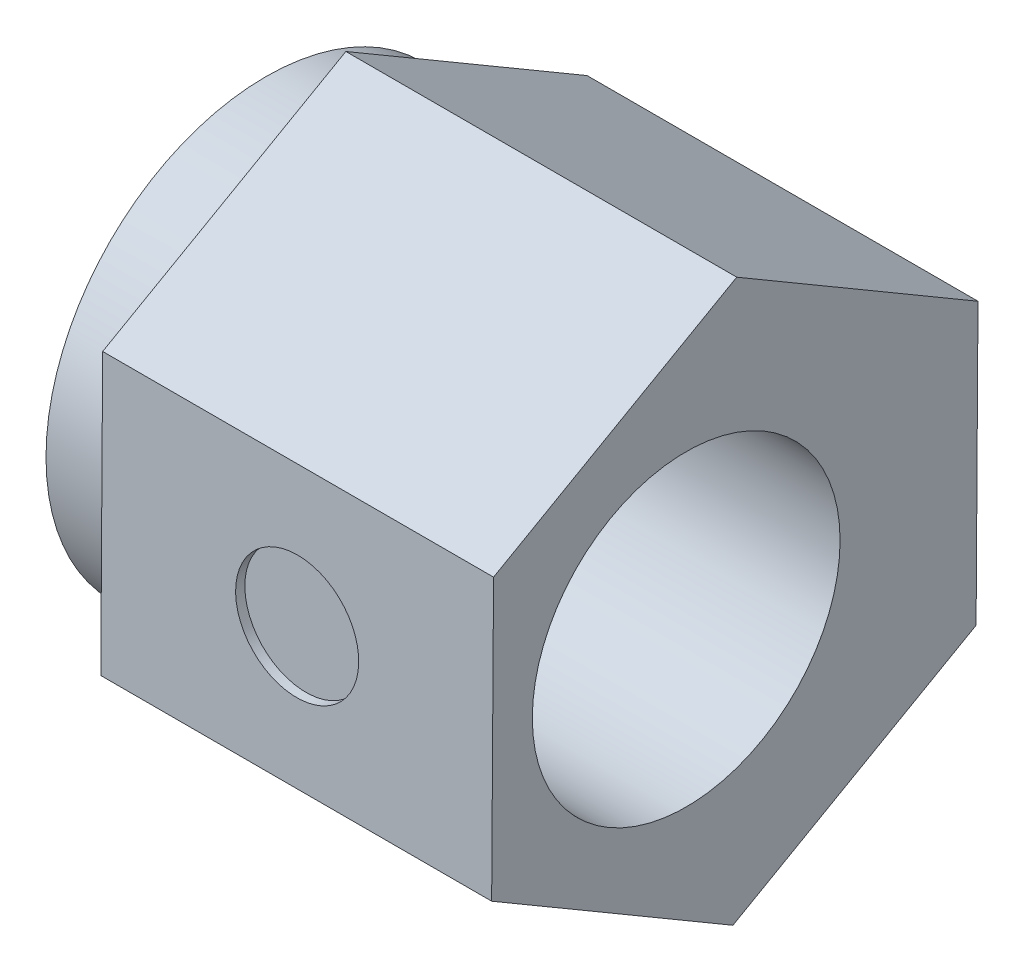
ISO-10303-21;
HEADER;
FILE_DESCRIPTION(('STEP AP214'),'2;1');
FILE_NAME('part.step','',(''),(''),'','','');
FILE_SCHEMA(('AUTOMOTIVE_DESIGN { 1 0 10303 214 1 1 1 1 }'));
ENDSEC;
DATA;
#1=APPLICATION_CONTEXT('core data for automotive mechanical design processes');
#2=APPLICATION_PROTOCOL_DEFINITION('international standard','automotive_design',2000,#1);
#3=PRODUCT_CONTEXT('',#1,'mechanical');
#4=PRODUCT('Part','Part','',(#3));
#5=PRODUCT_RELATED_PRODUCT_CATEGORY('part','',(#4));
#6=PRODUCT_DEFINITION_FORMATION('','',#4);
#7=PRODUCT_DEFINITION_CONTEXT('part definition',#1,'design');
#8=PRODUCT_DEFINITION('design','',#6,#7);
#9=PRODUCT_DEFINITION_SHAPE('','',#8);
#10=(LENGTH_UNIT() NAMED_UNIT(*) SI_UNIT(.MILLI.,.METRE.));
#11=(NAMED_UNIT(*) PLANE_ANGLE_UNIT() SI_UNIT($,.RADIAN.));
#12=(NAMED_UNIT(*) SI_UNIT($,.STERADIAN.) SOLID_ANGLE_UNIT());
#13=UNCERTAINTY_MEASURE_WITH_UNIT(LENGTH_MEASURE(1.E-05),#10,'distance_accuracy_value','');
#14=(GEOMETRIC_REPRESENTATION_CONTEXT(3) GLOBAL_UNCERTAINTY_ASSIGNED_CONTEXT((#13)) GLOBAL_UNIT_ASSIGNED_CONTEXT((#10,
#11,#12)) REPRESENTATION_CONTEXT('',''));
#15=CARTESIAN_POINT('',(0.,0.,0.));
#16=DIRECTION('',(0.,0.,1.));
#17=DIRECTION('',(1.,0.,0.));
#18=AXIS2_PLACEMENT_3D('',#15,#16,#17);
#19=CARTESIAN_POINT('',(6.35,2.29861751972744,3.91943756568916));
#20=DIRECTION('',(0.,-0.00680988299330344,-0.999976812477978));
#21=DIRECTION('',(0.,0.999976812477978,-0.00680988299330344));
#22=AXIS2_PLACEMENT_3D('',#19,#20,#21);
#23=PLANE('',#22);
#24=DIRECTION('',(0.,-0.999976812477978,0.00680988299330344));
#25=VECTOR('',#24,1.);
#26=CARTESIAN_POINT('',(0.,2.29861751972744,3.91943756568916));
#27=LINE('',#26,#25);
#28=CARTESIAN_POINT('',(0.,2.29861751972744,3.91943756568916));
#29=VERTEX_POINT('',#28);
#30=CARTESIAN_POINT('',(0.,-2.24502374057014,3.95037994851252));
#31=VERTEX_POINT('',#30);
#32=EDGE_CURVE('E74',#29,#31,#27,.T.);
#33=ORIENTED_EDGE('',*,*,#32,.T.);
#34=DIRECTION('',(-1.,0.,0.));
#35=VECTOR('',#34,1.);
#36=CARTESIAN_POINT('',(6.35,-2.24502374057014,3.95037994851252));
#37=LINE('',#36,#35);
#38=CARTESIAN_POINT('',(6.35,-2.24502374057014,3.95037994851252));
#39=VERTEX_POINT('',#38);
#40=EDGE_CURVE('E112',#39,#31,#37,.T.);
#41=ORIENTED_EDGE('',*,*,#40,.F.);
#42=DIRECTION('',(0.,-0.999976812477978,0.00680988299330344));
#43=VECTOR('',#42,1.);
#44=CARTESIAN_POINT('',(6.35,2.29861751972744,3.91943756568916));
#45=LINE('',#44,#43);
#46=CARTESIAN_POINT('',(6.35,2.29861751972744,3.91943756568916));
#47=VERTEX_POINT('',#46);
#48=EDGE_CURVE('E100',#47,#39,#45,.T.);
#49=ORIENTED_EDGE('',*,*,#48,.F.);
#50=DIRECTION('',(-1.,0.,0.));
#51=VECTOR('',#50,1.);
#52=CARTESIAN_POINT('',(6.35,2.29861751972744,3.91943756568916));
#53=LINE('',#52,#51);
#54=EDGE_CURVE('E107',#47,#29,#53,.T.);
#55=ORIENTED_EDGE('',*,*,#54,.T.);
#56=EDGE_LOOP('',(#33,#41,#49,#55));
#57=FACE_BOUND('',#56,.T.);
#58=CARTESIAN_POINT('',(3.175,0.026796889578649,3.93490875710084));
#59=DIRECTION('',(0.,-0.00680988299330344,-0.999976812477978));
#60=DIRECTION('',(0.,0.999976812477978,-0.00680988299330344));
#61=AXIS2_PLACEMENT_3D('',#58,#59,#60);
#62=CIRCLE('',#61,0.999999999999998);
#63=CARTESIAN_POINT('',(3.175,1.02677370205663,3.92809887410754));
#64=VERTEX_POINT('',#63);
#65=EDGE_CURVE('E160',#64,#64,#62,.T.);
#66=ORIENTED_EDGE('',*,*,#65,.T.);
#67=EDGE_LOOP('',(#66));
#68=FACE_BOUND('',#67,.T.);
#69=ADVANCED_FACE('F34',(#57,#68),#23,.F.);
#70=CARTESIAN_POINT('',(0.,0.,0.));
#71=DIRECTION('',(1.,0.,0.));
#72=DIRECTION('',(0.,0.,-1.));
#73=AXIS2_PLACEMENT_3D('',#70,#71,#72);
#74=PLANE('',#73);
#75=DIRECTION('',(0.,0.494090874569989,-0.869410264297968));
#76=VECTOR('',#75,1.);
#77=CARTESIAN_POINT('',(0.,-4.54364126029758,0.0309423828233433));
#78=LINE('',#77,#76);
#79=CARTESIAN_POINT('',(0.,-4.54364126029758,0.0309423828233433));
#80=VERTEX_POINT('',#79);
#81=CARTESIAN_POINT('',(0.,-2.29861751972745,-3.91943756568916));
#82=VERTEX_POINT('',#81);
#83=EDGE_CURVE('E120',#80,#82,#78,.T.);
#84=ORIENTED_EDGE('',*,*,#83,.F.);
#85=DIRECTION('',(0.,-0.50588593790799,-0.862600381304665));
#86=VECTOR('',#85,1.);
#87=CARTESIAN_POINT('',(0.,-2.24502374057014,3.95037994851252));
#88=LINE('',#87,#86);
#89=EDGE_CURVE('E80',#31,#80,#88,.T.);
#90=ORIENTED_EDGE('',*,*,#89,.F.);
#91=ORIENTED_EDGE('',*,*,#32,.F.);
#92=DIRECTION('',(0.,-0.494090874569989,0.869410264297968));
#93=VECTOR('',#92,1.);
#94=CARTESIAN_POINT('',(0.,4.54364126029758,-0.0309423828233572));
#95=LINE('',#94,#93);
#96=CARTESIAN_POINT('',(0.,4.54364126029758,-0.0309423828233572));
#97=VERTEX_POINT('',#96);
#98=EDGE_CURVE('E110',#97,#29,#95,.T.);
#99=ORIENTED_EDGE('',*,*,#98,.F.);
#100=DIRECTION('',(0.,0.505885937907989,0.862600381304665));
#101=VECTOR('',#100,1.);
#102=CARTESIAN_POINT('',(0.,2.24502374057014,-3.95037994851252));
#103=LINE('',#102,#101);
#104=CARTESIAN_POINT('',(0.,2.24502374057014,-3.95037994851252));
#105=VERTEX_POINT('',#104);
#106=EDGE_CURVE('E126',#105,#97,#103,.T.);
#107=ORIENTED_EDGE('',*,*,#106,.F.);
#108=DIRECTION('',(0.,0.999976812477978,-0.00680988299330266));
#109=VECTOR('',#108,1.);
#110=CARTESIAN_POINT('',(0.,-2.29861751972745,-3.91943756568916));
#111=LINE('',#110,#109);
#112=EDGE_CURVE('E123',#82,#105,#111,.T.);
#113=ORIENTED_EDGE('',*,*,#112,.F.);
#114=EDGE_LOOP('',(#84,#90,#91,#99,#107,#113));
#115=FACE_BOUND('',#114,.T.);
#116=CARTESIAN_POINT('',(0.,0.,0.));
#117=DIRECTION('',(1.,0.,0.));
#118=DIRECTION('',(0.,0.,-1.));
#119=AXIS2_PLACEMENT_3D('',#116,#117,#118);
#120=CIRCLE('',#119,3.57);
#121=CARTESIAN_POINT('',(0.,0.,-3.57));
#122=VERTEX_POINT('',#121);
#123=EDGE_CURVE('E11',#122,#122,#120,.F.);
#124=ORIENTED_EDGE('',*,*,#123,.F.);
#125=EDGE_LOOP('',(#124));
#126=FACE_BOUND('',#125,.T.);
#127=ADVANCED_FACE('F143',(#115,#126),#74,.F.);
#128=CARTESIAN_POINT('',(6.35,-4.54364126029758,0.0309423828233433));
#129=DIRECTION('',(0.,0.869410264297968,0.494090874569989));
#130=DIRECTION('',(0.,-0.494090874569989,0.869410264297969));
#131=AXIS2_PLACEMENT_3D('',#128,#129,#130);
#132=PLANE('',#131);
#133=ORIENTED_EDGE('',*,*,#83,.T.);
#134=DIRECTION('',(-1.,0.,0.));
#135=VECTOR('',#134,1.);
#136=CARTESIAN_POINT('',(6.35,-2.29861751972745,-3.91943756568916));
#137=LINE('',#136,#135);
#138=CARTESIAN_POINT('',(6.35,-2.29861751972745,-3.91943756568916));
#139=VERTEX_POINT('',#138);
#140=EDGE_CURVE('E43',#139,#82,#137,.T.);
#141=ORIENTED_EDGE('',*,*,#140,.F.);
#142=DIRECTION('',(0.,0.494090874569989,-0.869410264297968));
#143=VECTOR('',#142,1.);
#144=CARTESIAN_POINT('',(6.35,-4.54364126029758,0.0309423828233433));
#145=LINE('',#144,#143);
#146=CARTESIAN_POINT('',(6.35,-4.54364126029758,0.0309423828233433));
#147=VERTEX_POINT('',#146);
#148=EDGE_CURVE('E131',#147,#139,#145,.T.);
#149=ORIENTED_EDGE('',*,*,#148,.F.);
#150=DIRECTION('',(-1.,0.,0.));
#151=VECTOR('',#150,1.);
#152=CARTESIAN_POINT('',(6.35,-4.54364126029758,0.0309423828233433));
#153=LINE('',#152,#151);
#154=EDGE_CURVE('E116',#147,#80,#153,.T.);
#155=ORIENTED_EDGE('',*,*,#154,.T.);
#156=EDGE_LOOP('',(#133,#141,#149,#155));
#157=FACE_BOUND('',#156,.T.);
#158=ADVANCED_FACE('F36',(#157),#132,.F.);
#159=CARTESIAN_POINT('',(6.35,-2.29861751972745,-3.91943756568916));
#160=DIRECTION('',(0.,0.00680988299330266,0.999976812477978));
#161=DIRECTION('',(0.,-0.999976812477978,0.00680988299330266));
#162=AXIS2_PLACEMENT_3D('',#159,#160,#161);
#163=PLANE('',#162);
#164=ORIENTED_EDGE('',*,*,#112,.T.);
#165=DIRECTION('',(-1.,0.,0.));
#166=VECTOR('',#165,1.);
#167=CARTESIAN_POINT('',(6.35,2.24502374057014,-3.95037994851252));
#168=LINE('',#167,#166);
#169=CARTESIAN_POINT('',(6.35,2.24502374057014,-3.95037994851252));
#170=VERTEX_POINT('',#169);
#171=EDGE_CURVE('E135',#170,#105,#168,.T.);
#172=ORIENTED_EDGE('',*,*,#171,.F.);
#173=DIRECTION('',(0.,0.999976812477978,-0.00680988299330266));
#174=VECTOR('',#173,1.);
#175=CARTESIAN_POINT('',(6.35,-2.29861751972745,-3.91943756568916));
#176=LINE('',#175,#174);
#177=EDGE_CURVE('E89',#139,#170,#176,.T.);
#178=ORIENTED_EDGE('',*,*,#177,.F.);
#179=ORIENTED_EDGE('',*,*,#140,.T.);
#180=EDGE_LOOP('',(#164,#172,#178,#179));
#181=FACE_BOUND('',#180,.T.);
#182=ADVANCED_FACE('F138',(#181),#163,.F.);
#183=CARTESIAN_POINT('',(6.35,2.24502374057014,-3.95037994851252));
#184=DIRECTION('',(0.,-0.862600381304665,0.505885937907989));
#185=DIRECTION('',(0.,-0.505885937907989,-0.862600381304665));
#186=AXIS2_PLACEMENT_3D('',#183,#184,#185);
#187=PLANE('',#186);
#188=ORIENTED_EDGE('',*,*,#106,.T.);
#189=DIRECTION('',(-1.,0.,0.));
#190=VECTOR('',#189,1.);
#191=CARTESIAN_POINT('',(6.35,4.54364126029758,-0.0309423828233572));
#192=LINE('',#191,#190);
#193=CARTESIAN_POINT('',(6.35,4.54364126029758,-0.0309423828233572));
#194=VERTEX_POINT('',#193);
#195=EDGE_CURVE('E111',#194,#97,#192,.T.);
#196=ORIENTED_EDGE('',*,*,#195,.F.);
#197=DIRECTION('',(0.,0.505885937907989,0.862600381304665));
#198=VECTOR('',#197,1.);
#199=CARTESIAN_POINT('',(6.35,2.24502374057014,-3.95037994851252));
#200=LINE('',#199,#198);
#201=EDGE_CURVE('E102',#170,#194,#200,.T.);
#202=ORIENTED_EDGE('',*,*,#201,.F.);
#203=ORIENTED_EDGE('',*,*,#171,.T.);
#204=EDGE_LOOP('',(#188,#196,#202,#203));
#205=FACE_BOUND('',#204,.T.);
#206=ADVANCED_FACE('F147',(#205),#187,.F.);
#207=CARTESIAN_POINT('',(6.35,4.54364126029758,-0.0309423828233572));
#208=DIRECTION('',(0.,-0.869410264297968,-0.494090874569989));
#209=DIRECTION('',(0.,0.494090874569989,-0.869410264297969));
#210=AXIS2_PLACEMENT_3D('',#207,#208,#209);
#211=PLANE('',#210);
#212=ORIENTED_EDGE('',*,*,#98,.T.);
#213=ORIENTED_EDGE('',*,*,#54,.F.);
#214=DIRECTION('',(0.,-0.494090874569989,0.869410264297968));
#215=VECTOR('',#214,1.);
#216=CARTESIAN_POINT('',(6.35,4.54364126029758,-0.0309423828233572));
#217=LINE('',#216,#215);
#218=EDGE_CURVE('E96',#194,#47,#217,.T.);
#219=ORIENTED_EDGE('',*,*,#218,.F.);
#220=ORIENTED_EDGE('',*,*,#195,.T.);
#221=EDGE_LOOP('',(#212,#213,#219,#220));
#222=FACE_BOUND('',#221,.T.);
#223=ADVANCED_FACE('F108',(#222),#211,.F.);
#224=CARTESIAN_POINT('',(6.35,-2.24502374057014,3.95037994851252));
#225=DIRECTION('',(0.,0.862600381304665,-0.50588593790799));
#226=DIRECTION('',(0.,0.50588593790799,0.862600381304665));
#227=AXIS2_PLACEMENT_3D('',#224,#225,#226);
#228=PLANE('',#227);
#229=ORIENTED_EDGE('',*,*,#89,.T.);
#230=ORIENTED_EDGE('',*,*,#154,.F.);
#231=DIRECTION('',(0.,-0.50588593790799,-0.862600381304665));
#232=VECTOR('',#231,1.);
#233=CARTESIAN_POINT('',(6.35,-2.24502374057014,3.95037994851252));
#234=LINE('',#233,#232);
#235=EDGE_CURVE('E51',#39,#147,#234,.T.);
#236=ORIENTED_EDGE('',*,*,#235,.F.);
#237=ORIENTED_EDGE('',*,*,#40,.T.);
#238=EDGE_LOOP('',(#229,#230,#236,#237));
#239=FACE_BOUND('',#238,.T.);
#240=ADVANCED_FACE('F185',(#239),#228,.F.);
#241=CARTESIAN_POINT('',(6.35,0.,0.));
#242=DIRECTION('',(1.,0.,0.));
#243=DIRECTION('',(0.,0.,-1.));
#244=AXIS2_PLACEMENT_3D('',#241,#242,#243);
#245=PLANE('',#244);
#246=CARTESIAN_POINT('',(6.35,0.,0.79));
#247=DIRECTION('',(-1.,0.,0.));
#248=DIRECTION('',(0.,0.,1.));
#249=AXIS2_PLACEMENT_3D('',#246,#247,#248);
#250=CIRCLE('',#249,2.5);
#251=CARTESIAN_POINT('',(6.35,0.,3.29));
#252=VERTEX_POINT('',#251);
#253=EDGE_CURVE('E153',#252,#252,#250,.T.);
#254=ORIENTED_EDGE('',*,*,#253,.T.);
#255=EDGE_LOOP('',(#254));
#256=FACE_BOUND('',#255,.T.);
#257=ORIENTED_EDGE('',*,*,#148,.T.);
#258=ORIENTED_EDGE('',*,*,#177,.T.);
#259=ORIENTED_EDGE('',*,*,#201,.T.);
#260=ORIENTED_EDGE('',*,*,#218,.T.);
#261=ORIENTED_EDGE('',*,*,#48,.T.);
#262=ORIENTED_EDGE('',*,*,#235,.T.);
#263=EDGE_LOOP('',(#257,#258,#259,#260,#261,#262));
#264=FACE_BOUND('',#263,.T.);
#265=ADVANCED_FACE('F98',(#256,#264),#245,.T.);
#266=CARTESIAN_POINT('',(-1.27,0.,0.));
#267=DIRECTION('',(1.,0.,0.));
#268=DIRECTION('',(0.,0.,-1.));
#269=AXIS2_PLACEMENT_3D('',#266,#267,#268);
#270=CYLINDRICAL_SURFACE('',#269,3.57);
#271=CARTESIAN_POINT('',(-1.27,0.,0.));
#272=DIRECTION('',(-1.,0.,0.));
#273=DIRECTION('',(0.,0.,1.));
#274=AXIS2_PLACEMENT_3D('',#271,#272,#273);
#275=CIRCLE('',#274,3.57);
#276=CARTESIAN_POINT('',(-1.27,0.,3.57));
#277=VERTEX_POINT('',#276);
#278=EDGE_CURVE('E124',#277,#277,#275,.T.);
#279=ORIENTED_EDGE('',*,*,#278,.F.);
#280=EDGE_LOOP('',(#279));
#281=FACE_BOUND('',#280,.T.);
#282=ORIENTED_EDGE('',*,*,#123,.T.);
#283=EDGE_LOOP('',(#282));
#284=FACE_BOUND('',#283,.T.);
#285=ADVANCED_FACE('F211',(#281,#284),#270,.T.);
#286=CARTESIAN_POINT('',(-1.27,0.,0.));
#287=DIRECTION('',(-1.,0.,0.));
#288=DIRECTION('',(0.,0.,1.));
#289=AXIS2_PLACEMENT_3D('',#286,#287,#288);
#290=PLANE('',#289);
#291=CARTESIAN_POINT('',(-1.27,0.,0.79));
#292=DIRECTION('',(-1.,0.,0.));
#293=DIRECTION('',(0.,0.,1.));
#294=AXIS2_PLACEMENT_3D('',#291,#292,#293);
#295=CIRCLE('',#294,2.5);
#296=CARTESIAN_POINT('',(-1.27,0.,3.29));
#297=VERTEX_POINT('',#296);
#298=EDGE_CURVE('E154',#297,#297,#295,.T.);
#299=ORIENTED_EDGE('',*,*,#298,.F.);
#300=EDGE_LOOP('',(#299));
#301=FACE_BOUND('',#300,.T.);
#302=ORIENTED_EDGE('',*,*,#278,.T.);
#303=EDGE_LOOP('',(#302));
#304=FACE_BOUND('',#303,.T.);
#305=ADVANCED_FACE('F215',(#301,#304),#290,.T.);
#306=CARTESIAN_POINT('',(6.35,0.,0.79));
#307=DIRECTION('',(-1.,0.,0.));
#308=DIRECTION('',(0.,0.,1.));
#309=AXIS2_PLACEMENT_3D('',#306,#307,#308);
#310=CYLINDRICAL_SURFACE('',#309,2.5);
#311=ORIENTED_EDGE('',*,*,#253,.F.);
#312=EDGE_LOOP('',(#311));
#313=FACE_BOUND('',#312,.T.);
#314=ORIENTED_EDGE('',*,*,#298,.T.);
#315=EDGE_LOOP('',(#314));
#316=FACE_BOUND('',#315,.T.);
#317=ADVANCED_FACE('F175',(#313,#316),#310,.F.);
#318=CARTESIAN_POINT('',(3.175,0.0257754071296535,3.78491223522914));
#319=DIRECTION('',(0.,0.00680988299330344,0.999976812477978));
#320=DIRECTION('',(0.,-0.999976812477978,0.00680988299330344));
#321=AXIS2_PLACEMENT_3D('',#318,#319,#320);
#322=CYLINDRICAL_SURFACE('',#321,0.999999999999998);
#323=CARTESIAN_POINT('',(3.175,0.0257754071296535,3.78491223522914));
#324=DIRECTION('',(0.,-0.00680988299330344,-0.999976812477978));
#325=DIRECTION('',(0.,0.999976812477978,-0.00680988299330344));
#326=AXIS2_PLACEMENT_3D('',#323,#324,#325);
#327=CIRCLE('',#326,0.999999999999998);
#328=CARTESIAN_POINT('',(3.175,1.02575221960763,3.77810235223584));
#329=VERTEX_POINT('',#328);
#330=EDGE_CURVE('E157',#329,#329,#327,.T.);
#331=ORIENTED_EDGE('',*,*,#330,.T.);
#332=EDGE_LOOP('',(#331));
#333=FACE_BOUND('',#332,.T.);
#334=ORIENTED_EDGE('',*,*,#65,.F.);
#335=EDGE_LOOP('',(#334));
#336=FACE_BOUND('',#335,.T.);
#337=ADVANCED_FACE('F166',(#333,#336),#322,.F.);
#338=CARTESIAN_POINT('',(3.175,0.0257754071296535,3.78491223522914));
#339=DIRECTION('',(0.,-0.00680988299330344,-0.999976812477978));
#340=DIRECTION('',(0.,0.999976812477978,-0.00680988299330344));
#341=AXIS2_PLACEMENT_3D('',#338,#339,#340);
#342=PLANE('',#341);
#343=ORIENTED_EDGE('',*,*,#330,.F.);
#344=EDGE_LOOP('',(#343));
#345=FACE_BOUND('',#344,.T.);
#346=ADVANCED_FACE('F169',(#345),#342,.F.);
#347=CLOSED_SHELL('',(#69,#127,#158,#182,#206,#223,#240,#265,#285,#305,#317,#337,#346));
#348=MANIFOLD_SOLID_BREP('B2',#347);
#349=ADVANCED_BREP_SHAPE_REPRESENTATION('',(#18,#348),#14);
#350=SHAPE_DEFINITION_REPRESENTATION(#9,#349);
ENDSEC;
END-ISO-10303-21;
